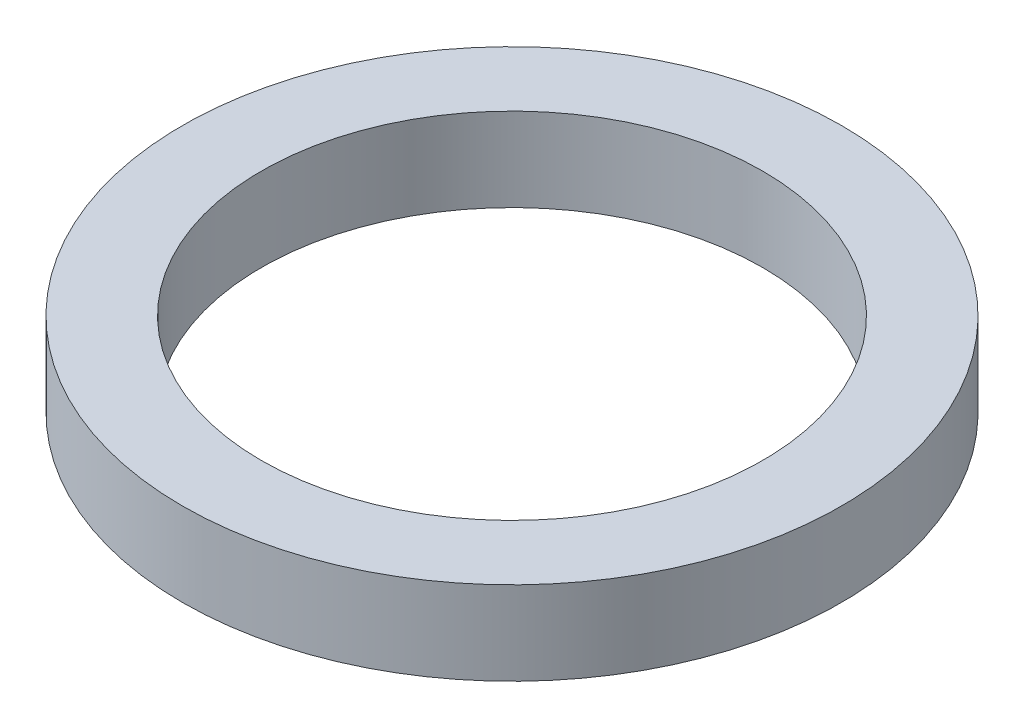
ISO-10303-21;
HEADER;
FILE_DESCRIPTION(('STEP AP214'),'2;1');
FILE_NAME('part.step','',(''),(''),'','','');
FILE_SCHEMA(('AUTOMOTIVE_DESIGN { 1 0 10303 214 1 1 1 1 }'));
ENDSEC;
DATA;
#1=APPLICATION_CONTEXT('core data for automotive mechanical design processes');
#2=APPLICATION_PROTOCOL_DEFINITION('international standard','automotive_design',2000,#1);
#3=PRODUCT_CONTEXT('',#1,'mechanical');
#4=PRODUCT('Part','Part','',(#3));
#5=PRODUCT_RELATED_PRODUCT_CATEGORY('part','',(#4));
#6=PRODUCT_DEFINITION_FORMATION('','',#4);
#7=PRODUCT_DEFINITION_CONTEXT('part definition',#1,'design');
#8=PRODUCT_DEFINITION('design','',#6,#7);
#9=PRODUCT_DEFINITION_SHAPE('','',#8);
#10=(LENGTH_UNIT() NAMED_UNIT(*) SI_UNIT(.MILLI.,.METRE.));
#11=(NAMED_UNIT(*) PLANE_ANGLE_UNIT() SI_UNIT($,.RADIAN.));
#12=(NAMED_UNIT(*) SI_UNIT($,.STERADIAN.) SOLID_ANGLE_UNIT());
#13=UNCERTAINTY_MEASURE_WITH_UNIT(LENGTH_MEASURE(1.E-05),#10,'distance_accuracy_value','');
#14=(GEOMETRIC_REPRESENTATION_CONTEXT(3) GLOBAL_UNCERTAINTY_ASSIGNED_CONTEXT((#13)) GLOBAL_UNIT_ASSIGNED_CONTEXT((#10,
#11,#12)) REPRESENTATION_CONTEXT('',''));
#15=CARTESIAN_POINT('',(0.,0.,0.));
#16=DIRECTION('',(0.,0.,1.));
#17=DIRECTION('',(1.,0.,0.));
#18=AXIS2_PLACEMENT_3D('',#15,#16,#17);
#19=CARTESIAN_POINT('',(0.,1.5875,0.));
#20=DIRECTION('',(0.,1.,0.));
#21=DIRECTION('',(0.,0.,1.));
#22=AXIS2_PLACEMENT_3D('',#19,#20,#21);
#23=PLANE('',#22);
#24=CARTESIAN_POINT('',(0.,1.5875,0.));
#25=DIRECTION('',(0.,1.,0.));
#26=DIRECTION('',(0.,0.,1.));
#27=AXIS2_PLACEMENT_3D('',#24,#25,#26);
#28=CIRCLE('',#27,6.2611);
#29=CARTESIAN_POINT('',(0.,1.5875,6.2611));
#30=VERTEX_POINT('',#29);
#31=EDGE_CURVE('E10',#30,#30,#28,.T.);
#32=ORIENTED_EDGE('',*,*,#31,.T.);
#33=EDGE_LOOP('',(#32));
#34=FACE_BOUND('',#33,.T.);
#35=CARTESIAN_POINT('',(0.,1.5875,0.));
#36=DIRECTION('',(0.,1.,0.));
#37=DIRECTION('',(0.,0.,1.));
#38=AXIS2_PLACEMENT_3D('',#35,#36,#37);
#39=CIRCLE('',#38,4.7625);
#40=CARTESIAN_POINT('',(0.,1.5875,4.7625));
#41=VERTEX_POINT('',#40);
#42=EDGE_CURVE('E42',#41,#41,#39,.T.);
#43=ORIENTED_EDGE('',*,*,#42,.F.);
#44=EDGE_LOOP('',(#43));
#45=FACE_BOUND('',#44,.T.);
#46=ADVANCED_FACE('F31',(#34,#45),#23,.T.);
#47=CARTESIAN_POINT('',(0.,0.,0.));
#48=DIRECTION('',(0.,1.,0.));
#49=DIRECTION('',(0.,0.,1.));
#50=AXIS2_PLACEMENT_3D('',#47,#48,#49);
#51=PLANE('',#50);
#52=CARTESIAN_POINT('',(0.,0.,0.));
#53=DIRECTION('',(0.,1.,0.));
#54=DIRECTION('',(0.,0.,1.));
#55=AXIS2_PLACEMENT_3D('',#52,#53,#54);
#56=CIRCLE('',#55,6.2611);
#57=CARTESIAN_POINT('',(0.,0.,6.2611));
#58=VERTEX_POINT('',#57);
#59=EDGE_CURVE('E35',#58,#58,#56,.T.);
#60=ORIENTED_EDGE('',*,*,#59,.F.);
#61=EDGE_LOOP('',(#60));
#62=FACE_BOUND('',#61,.T.);
#63=CARTESIAN_POINT('',(0.,0.,0.));
#64=DIRECTION('',(0.,1.,0.));
#65=DIRECTION('',(0.,0.,1.));
#66=AXIS2_PLACEMENT_3D('',#63,#64,#65);
#67=CIRCLE('',#66,4.7625);
#68=CARTESIAN_POINT('',(0.,0.,4.7625));
#69=VERTEX_POINT('',#68);
#70=EDGE_CURVE('E44',#69,#69,#67,.T.);
#71=ORIENTED_EDGE('',*,*,#70,.T.);
#72=EDGE_LOOP('',(#71));
#73=FACE_BOUND('',#72,.T.);
#74=ADVANCED_FACE('F54',(#62,#73),#51,.F.);
#75=CARTESIAN_POINT('',(0.,1.5875,0.));
#76=DIRECTION('',(0.,-1.,0.));
#77=DIRECTION('',(0.,0.,-1.));
#78=AXIS2_PLACEMENT_3D('',#75,#76,#77);
#79=CYLINDRICAL_SURFACE('',#78,6.2611);
#80=ORIENTED_EDGE('',*,*,#31,.F.);
#81=EDGE_LOOP('',(#80));
#82=FACE_BOUND('',#81,.T.);
#83=ORIENTED_EDGE('',*,*,#59,.T.);
#84=EDGE_LOOP('',(#83));
#85=FACE_BOUND('',#84,.T.);
#86=ADVANCED_FACE('F33',(#82,#85),#79,.T.);
#87=CARTESIAN_POINT('',(0.,1.5875,0.));
#88=DIRECTION('',(0.,-1.,0.));
#89=DIRECTION('',(0.,0.,-1.));
#90=AXIS2_PLACEMENT_3D('',#87,#88,#89);
#91=CYLINDRICAL_SURFACE('',#90,4.7625);
#92=ORIENTED_EDGE('',*,*,#42,.T.);
#93=EDGE_LOOP('',(#92));
#94=FACE_BOUND('',#93,.T.);
#95=ORIENTED_EDGE('',*,*,#70,.F.);
#96=EDGE_LOOP('',(#95));
#97=FACE_BOUND('',#96,.T.);
#98=ADVANCED_FACE('F50',(#94,#97),#91,.F.);
#99=CLOSED_SHELL('',(#46,#74,#86,#98));
#100=MANIFOLD_SOLID_BREP('B2',#99);
#101=ADVANCED_BREP_SHAPE_REPRESENTATION('',(#18,#100),#14);
#102=SHAPE_DEFINITION_REPRESENTATION(#9,#101);
ENDSEC;
END-ISO-10303-21;
